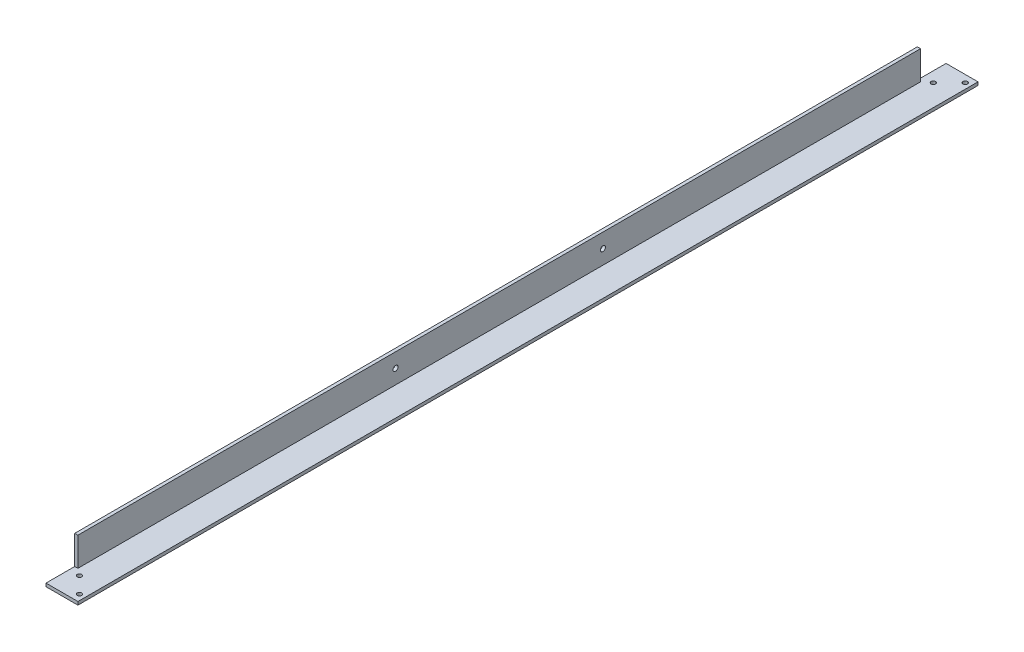
ISO-10303-21;
HEADER;
FILE_DESCRIPTION(('STEP AP214'),'2;1');
FILE_NAME('part.step','',(''),(''),'','','');
FILE_SCHEMA(('AUTOMOTIVE_DESIGN { 1 0 10303 214 1 1 1 1 }'));
ENDSEC;
DATA;
#1=APPLICATION_CONTEXT('core data for automotive mechanical design processes');
#2=APPLICATION_PROTOCOL_DEFINITION('international standard','automotive_design',2000,#1);
#3=PRODUCT_CONTEXT('',#1,'mechanical');
#4=PRODUCT('Part','Part','',(#3));
#5=PRODUCT_RELATED_PRODUCT_CATEGORY('part','',(#4));
#6=PRODUCT_DEFINITION_FORMATION('','',#4);
#7=PRODUCT_DEFINITION_CONTEXT('part definition',#1,'design');
#8=PRODUCT_DEFINITION('design','',#6,#7);
#9=PRODUCT_DEFINITION_SHAPE('','',#8);
#10=(LENGTH_UNIT() NAMED_UNIT(*) SI_UNIT(.MILLI.,.METRE.));
#11=(NAMED_UNIT(*) PLANE_ANGLE_UNIT() SI_UNIT($,.RADIAN.));
#12=(NAMED_UNIT(*) SI_UNIT($,.STERADIAN.) SOLID_ANGLE_UNIT());
#13=UNCERTAINTY_MEASURE_WITH_UNIT(LENGTH_MEASURE(1.E-05),#10,'distance_accuracy_value','');
#14=(GEOMETRIC_REPRESENTATION_CONTEXT(3) GLOBAL_UNCERTAINTY_ASSIGNED_CONTEXT((#13)) GLOBAL_UNIT_ASSIGNED_CONTEXT((#10,
#11,#12)) REPRESENTATION_CONTEXT('',''));
#15=CARTESIAN_POINT('',(0.,0.,0.));
#16=DIRECTION('',(0.,0.,1.));
#17=DIRECTION('',(1.,0.,0.));
#18=AXIS2_PLACEMENT_3D('',#15,#16,#17);
#19=CARTESIAN_POINT('',(0.,20.,564.));
#20=DIRECTION('',(1.,0.,0.));
#21=DIRECTION('',(0.,0.,-1.));
#22=AXIS2_PLACEMENT_3D('',#19,#20,#21);
#23=PLANE('',#22);
#24=CARTESIAN_POINT('',(0.,11.,217.));
#25=DIRECTION('',(-1.,0.,0.));
#26=DIRECTION('',(0.,0.,1.));
#27=AXIS2_PLACEMENT_3D('',#24,#25,#26);
#28=CIRCLE('',#27,1.59999999999999);
#29=CARTESIAN_POINT('',(0.,11.,218.6));
#30=VERTEX_POINT('',#29);
#31=EDGE_CURVE('E179',#30,#30,#28,.T.);
#32=ORIENTED_EDGE('',*,*,#31,.F.);
#33=EDGE_LOOP('',(#32));
#34=FACE_BOUND('',#33,.T.);
#35=CARTESIAN_POINT('',(0.,11.,347.));
#36=DIRECTION('',(-1.,0.,0.));
#37=DIRECTION('',(0.,0.,1.));
#38=AXIS2_PLACEMENT_3D('',#35,#36,#37);
#39=CIRCLE('',#38,1.59999999999996);
#40=CARTESIAN_POINT('',(0.,11.,348.6));
#41=VERTEX_POINT('',#40);
#42=EDGE_CURVE('E185',#41,#41,#39,.T.);
#43=ORIENTED_EDGE('',*,*,#42,.F.);
#44=EDGE_LOOP('',(#43));
#45=FACE_BOUND('',#44,.T.);
#46=DIRECTION('',(0.,0.,-1.));
#47=VECTOR('',#46,1.);
#48=CARTESIAN_POINT('',(0.,2.,564.));
#49=LINE('',#48,#47);
#50=CARTESIAN_POINT('',(0.,2.,564.));
#51=VERTEX_POINT('',#50);
#52=CARTESIAN_POINT('',(0.,2.,546.));
#53=VERTEX_POINT('',#52);
#54=EDGE_CURVE('E119',#51,#53,#49,.T.);
#55=ORIENTED_EDGE('',*,*,#54,.T.);
#56=DIRECTION('',(0.,1.,0.));
#57=VECTOR('',#56,1.);
#58=CARTESIAN_POINT('',(0.,20.,546.));
#59=LINE('',#58,#57);
#60=CARTESIAN_POINT('',(0.,20.,546.));
#61=VERTEX_POINT('',#60);
#62=EDGE_CURVE('E125',#53,#61,#59,.T.);
#63=ORIENTED_EDGE('',*,*,#62,.T.);
#64=DIRECTION('',(0.,0.,-1.));
#65=VECTOR('',#64,1.);
#66=CARTESIAN_POINT('',(0.,20.,564.));
#67=LINE('',#66,#65);
#68=CARTESIAN_POINT('',(0.,20.,18.));
#69=VERTEX_POINT('',#68);
#70=EDGE_CURVE('E164',#61,#69,#67,.T.);
#71=ORIENTED_EDGE('',*,*,#70,.T.);
#72=DIRECTION('',(0.,-1.,0.));
#73=VECTOR('',#72,1.);
#74=CARTESIAN_POINT('',(0.,20.,18.));
#75=LINE('',#74,#73);
#76=CARTESIAN_POINT('',(0.,2.,18.));
#77=VERTEX_POINT('',#76);
#78=EDGE_CURVE('E145',#69,#77,#75,.T.);
#79=ORIENTED_EDGE('',*,*,#78,.T.);
#80=DIRECTION('',(0.,0.,-1.));
#81=VECTOR('',#80,1.);
#82=CARTESIAN_POINT('',(0.,2.,0.));
#83=LINE('',#82,#81);
#84=CARTESIAN_POINT('',(0.,2.,0.));
#85=VERTEX_POINT('',#84);
#86=EDGE_CURVE('E148',#77,#85,#83,.T.);
#87=ORIENTED_EDGE('',*,*,#86,.T.);
#88=DIRECTION('',(0.,-1.,0.));
#89=VECTOR('',#88,1.);
#90=CARTESIAN_POINT('',(0.,20.,0.));
#91=LINE('',#90,#89);
#92=CARTESIAN_POINT('',(0.,0.,0.));
#93=VERTEX_POINT('',#92);
#94=EDGE_CURVE('E143',#85,#93,#91,.T.);
#95=ORIENTED_EDGE('',*,*,#94,.T.);
#96=DIRECTION('',(0.,0.,-1.));
#97=VECTOR('',#96,1.);
#98=CARTESIAN_POINT('',(0.,0.,564.));
#99=LINE('',#98,#97);
#100=CARTESIAN_POINT('',(0.,0.,564.));
#101=VERTEX_POINT('',#100);
#102=EDGE_CURVE('E11',#101,#93,#99,.T.);
#103=ORIENTED_EDGE('',*,*,#102,.F.);
#104=DIRECTION('',(0.,-1.,0.));
#105=VECTOR('',#104,1.);
#106=CARTESIAN_POINT('',(0.,20.,564.));
#107=LINE('',#106,#105);
#108=EDGE_CURVE('E85',#51,#101,#107,.T.);
#109=ORIENTED_EDGE('',*,*,#108,.F.);
#110=EDGE_LOOP('',(#55,#63,#71,#79,#87,#95,#103,#109));
#111=FACE_BOUND('',#110,.T.);
#112=ADVANCED_FACE('F43',(#34,#45,#111),#23,.F.);
#113=CARTESIAN_POINT('',(0.,0.,564.));
#114=DIRECTION('',(0.,1.,0.));
#115=DIRECTION('',(0.,0.,1.));
#116=AXIS2_PLACEMENT_3D('',#113,#114,#115);
#117=PLANE('',#116);
#118=CARTESIAN_POINT('',(16.48,0.,4.48000000000001));
#119=DIRECTION('',(0.,1.,0.));
#120=DIRECTION('',(1.,0.,0.));
#121=AXIS2_PLACEMENT_3D('',#118,#119,#120);
#122=CIRCLE('',#121,1.4);
#123=CARTESIAN_POINT('',(17.88,0.,4.48000000000001));
#124=VERTEX_POINT('',#123);
#125=EDGE_CURVE('E204',#124,#124,#122,.T.);
#126=ORIENTED_EDGE('',*,*,#125,.T.);
#127=EDGE_LOOP('',(#126));
#128=FACE_BOUND('',#127,.T.);
#129=CARTESIAN_POINT('',(16.48,0.,559.52));
#130=DIRECTION('',(0.,1.,0.));
#131=DIRECTION('',(-1.,0.,0.));
#132=AXIS2_PLACEMENT_3D('',#129,#130,#131);
#133=CIRCLE('',#132,1.39999999999999);
#134=CARTESIAN_POINT('',(15.08,0.,559.52));
#135=VERTEX_POINT('',#134);
#136=EDGE_CURVE('E198',#135,#135,#133,.T.);
#137=ORIENTED_EDGE('',*,*,#136,.T.);
#138=EDGE_LOOP('',(#137));
#139=FACE_BOUND('',#138,.T.);
#140=CARTESIAN_POINT('',(6.48,0.,14.48));
#141=DIRECTION('',(0.,1.,0.));
#142=DIRECTION('',(1.,0.,0.));
#143=AXIS2_PLACEMENT_3D('',#140,#141,#142);
#144=CIRCLE('',#143,1.4);
#145=CARTESIAN_POINT('',(7.88,0.,14.48));
#146=VERTEX_POINT('',#145);
#147=EDGE_CURVE('E192',#146,#146,#144,.T.);
#148=ORIENTED_EDGE('',*,*,#147,.T.);
#149=EDGE_LOOP('',(#148));
#150=FACE_BOUND('',#149,.T.);
#151=CARTESIAN_POINT('',(6.48,0.,549.52));
#152=DIRECTION('',(0.,1.,0.));
#153=DIRECTION('',(-1.,0.,0.));
#154=AXIS2_PLACEMENT_3D('',#151,#152,#153);
#155=CIRCLE('',#154,1.39999999999998);
#156=CARTESIAN_POINT('',(5.08000000000002,0.,549.52));
#157=VERTEX_POINT('',#156);
#158=EDGE_CURVE('E155',#157,#157,#155,.T.);
#159=ORIENTED_EDGE('',*,*,#158,.T.);
#160=EDGE_LOOP('',(#159));
#161=FACE_BOUND('',#160,.T.);
#162=DIRECTION('',(1.,0.,0.));
#163=VECTOR('',#162,1.);
#164=CARTESIAN_POINT('',(0.,0.,0.));
#165=LINE('',#164,#163);
#166=CARTESIAN_POINT('',(20.,0.,0.));
#167=VERTEX_POINT('',#166);
#168=EDGE_CURVE('E166',#93,#167,#165,.T.);
#169=ORIENTED_EDGE('',*,*,#168,.T.);
#170=DIRECTION('',(0.,0.,-1.));
#171=VECTOR('',#170,1.);
#172=CARTESIAN_POINT('',(20.,0.,564.));
#173=LINE('',#172,#171);
#174=CARTESIAN_POINT('',(20.,0.,564.));
#175=VERTEX_POINT('',#174);
#176=EDGE_CURVE('E51',#175,#167,#173,.T.);
#177=ORIENTED_EDGE('',*,*,#176,.F.);
#178=DIRECTION('',(1.,0.,0.));
#179=VECTOR('',#178,1.);
#180=CARTESIAN_POINT('',(0.,0.,564.));
#181=LINE('',#180,#179);
#182=EDGE_CURVE('E159',#101,#175,#181,.T.);
#183=ORIENTED_EDGE('',*,*,#182,.F.);
#184=ORIENTED_EDGE('',*,*,#102,.T.);
#185=EDGE_LOOP('',(#169,#177,#183,#184));
#186=FACE_BOUND('',#185,.T.);
#187=ADVANCED_FACE('F229',(#128,#139,#150,#161,#186),#117,.F.);
#188=CARTESIAN_POINT('',(20.,0.,564.));
#189=DIRECTION('',(-1.,0.,0.));
#190=DIRECTION('',(0.,0.,1.));
#191=AXIS2_PLACEMENT_3D('',#188,#189,#190);
#192=PLANE('',#191);
#193=DIRECTION('',(0.,1.,0.));
#194=VECTOR('',#193,1.);
#195=CARTESIAN_POINT('',(20.,0.,0.));
#196=LINE('',#195,#194);
#197=CARTESIAN_POINT('',(20.,2.,0.));
#198=VERTEX_POINT('',#197);
#199=EDGE_CURVE('E82',#167,#198,#196,.T.);
#200=ORIENTED_EDGE('',*,*,#199,.T.);
#201=DIRECTION('',(0.,0.,-1.));
#202=VECTOR('',#201,1.);
#203=CARTESIAN_POINT('',(20.,2.,564.));
#204=LINE('',#203,#202);
#205=CARTESIAN_POINT('',(20.,2.,564.));
#206=VERTEX_POINT('',#205);
#207=EDGE_CURVE('E175',#206,#198,#204,.T.);
#208=ORIENTED_EDGE('',*,*,#207,.F.);
#209=DIRECTION('',(0.,1.,0.));
#210=VECTOR('',#209,1.);
#211=CARTESIAN_POINT('',(20.,0.,564.));
#212=LINE('',#211,#210);
#213=EDGE_CURVE('E65',#175,#206,#212,.T.);
#214=ORIENTED_EDGE('',*,*,#213,.F.);
#215=ORIENTED_EDGE('',*,*,#176,.T.);
#216=EDGE_LOOP('',(#200,#208,#214,#215));
#217=FACE_BOUND('',#216,.T.);
#218=ADVANCED_FACE('F218',(#217),#192,.F.);
#219=CARTESIAN_POINT('',(20.,2.,564.));
#220=DIRECTION('',(0.,-1.,0.));
#221=DIRECTION('',(1.,0.,0.));
#222=AXIS2_PLACEMENT_3D('',#219,#220,#221);
#223=PLANE('',#222);
#224=CARTESIAN_POINT('',(16.48,2.,4.48000000000001));
#225=DIRECTION('',(0.,1.,0.));
#226=DIRECTION('',(1.,0.,0.));
#227=AXIS2_PLACEMENT_3D('',#224,#225,#226);
#228=CIRCLE('',#227,1.4);
#229=CARTESIAN_POINT('',(17.88,2.,4.48000000000001));
#230=VERTEX_POINT('',#229);
#231=EDGE_CURVE('E183',#230,#230,#228,.T.);
#232=ORIENTED_EDGE('',*,*,#231,.F.);
#233=EDGE_LOOP('',(#232));
#234=FACE_BOUND('',#233,.T.);
#235=CARTESIAN_POINT('',(16.48,2.,559.52));
#236=DIRECTION('',(0.,1.,0.));
#237=DIRECTION('',(-1.,0.,0.));
#238=AXIS2_PLACEMENT_3D('',#235,#236,#237);
#239=CIRCLE('',#238,1.39999999999999);
#240=CARTESIAN_POINT('',(15.08,2.,559.52));
#241=VERTEX_POINT('',#240);
#242=EDGE_CURVE('E201',#241,#241,#239,.T.);
#243=ORIENTED_EDGE('',*,*,#242,.F.);
#244=EDGE_LOOP('',(#243));
#245=FACE_BOUND('',#244,.T.);
#246=CARTESIAN_POINT('',(6.48,2.,14.48));
#247=DIRECTION('',(0.,1.,0.));
#248=DIRECTION('',(1.,0.,0.));
#249=AXIS2_PLACEMENT_3D('',#246,#247,#248);
#250=CIRCLE('',#249,1.4);
#251=CARTESIAN_POINT('',(7.88,2.,14.48));
#252=VERTEX_POINT('',#251);
#253=EDGE_CURVE('E195',#252,#252,#250,.T.);
#254=ORIENTED_EDGE('',*,*,#253,.F.);
#255=EDGE_LOOP('',(#254));
#256=FACE_BOUND('',#255,.T.);
#257=CARTESIAN_POINT('',(6.48,2.,549.52));
#258=DIRECTION('',(0.,1.,0.));
#259=DIRECTION('',(-1.,0.,0.));
#260=AXIS2_PLACEMENT_3D('',#257,#258,#259);
#261=CIRCLE('',#260,1.39999999999998);
#262=CARTESIAN_POINT('',(5.08000000000002,2.,549.52));
#263=VERTEX_POINT('',#262);
#264=EDGE_CURVE('E140',#263,#263,#261,.T.);
#265=ORIENTED_EDGE('',*,*,#264,.F.);
#266=EDGE_LOOP('',(#265));
#267=FACE_BOUND('',#266,.T.);
#268=DIRECTION('',(-1.,0.,0.));
#269=VECTOR('',#268,1.);
#270=CARTESIAN_POINT('',(20.,2.,0.));
#271=LINE('',#270,#269);
#272=EDGE_CURVE('E160',#198,#85,#271,.T.);
#273=ORIENTED_EDGE('',*,*,#272,.T.);
#274=ORIENTED_EDGE('',*,*,#86,.F.);
#275=DIRECTION('',(1.,0.,0.));
#276=VECTOR('',#275,1.);
#277=CARTESIAN_POINT('',(0.,2.,18.));
#278=LINE('',#277,#276);
#279=CARTESIAN_POINT('',(2.,2.,18.));
#280=VERTEX_POINT('',#279);
#281=EDGE_CURVE('E137',#77,#280,#278,.T.);
#282=ORIENTED_EDGE('',*,*,#281,.T.);
#283=DIRECTION('',(0.,0.,-1.));
#284=VECTOR('',#283,1.);
#285=CARTESIAN_POINT('',(2.,2.,564.));
#286=LINE('',#285,#284);
#287=CARTESIAN_POINT('',(2.,2.,546.));
#288=VERTEX_POINT('',#287);
#289=EDGE_CURVE('E121',#288,#280,#286,.T.);
#290=ORIENTED_EDGE('',*,*,#289,.F.);
#291=DIRECTION('',(1.,0.,0.));
#292=VECTOR('',#291,1.);
#293=CARTESIAN_POINT('',(0.,2.,546.));
#294=LINE('',#293,#292);
#295=EDGE_CURVE('E115',#53,#288,#294,.T.);
#296=ORIENTED_EDGE('',*,*,#295,.F.);
#297=ORIENTED_EDGE('',*,*,#54,.F.);
#298=DIRECTION('',(-1.,0.,0.));
#299=VECTOR('',#298,1.);
#300=CARTESIAN_POINT('',(20.,2.,564.));
#301=LINE('',#300,#299);
#302=EDGE_CURVE('E59',#206,#51,#301,.T.);
#303=ORIENTED_EDGE('',*,*,#302,.F.);
#304=ORIENTED_EDGE('',*,*,#207,.T.);
#305=EDGE_LOOP('',(#273,#274,#282,#290,#296,#297,#303,#304));
#306=FACE_BOUND('',#305,.T.);
#307=ADVANCED_FACE('F117',(#234,#245,#256,#267,#306),#223,.F.);
#308=CARTESIAN_POINT('',(2.,2.,564.));
#309=DIRECTION('',(-1.,0.,0.));
#310=DIRECTION('',(0.,0.,1.));
#311=AXIS2_PLACEMENT_3D('',#308,#309,#310);
#312=PLANE('',#311);
#313=CARTESIAN_POINT('',(2.,11.,217.));
#314=DIRECTION('',(-1.,0.,0.));
#315=DIRECTION('',(0.,0.,1.));
#316=AXIS2_PLACEMENT_3D('',#313,#314,#315);
#317=CIRCLE('',#316,1.59999999999999);
#318=CARTESIAN_POINT('',(2.,11.,218.6));
#319=VERTEX_POINT('',#318);
#320=EDGE_CURVE('E46',#319,#319,#317,.T.);
#321=ORIENTED_EDGE('',*,*,#320,.T.);
#322=EDGE_LOOP('',(#321));
#323=FACE_BOUND('',#322,.T.);
#324=CARTESIAN_POINT('',(2.,11.,347.));
#325=DIRECTION('',(-1.,0.,0.));
#326=DIRECTION('',(0.,0.,1.));
#327=AXIS2_PLACEMENT_3D('',#324,#325,#326);
#328=CIRCLE('',#327,1.59999999999996);
#329=CARTESIAN_POINT('',(2.,11.,348.6));
#330=VERTEX_POINT('',#329);
#331=EDGE_CURVE('E177',#330,#330,#328,.T.);
#332=ORIENTED_EDGE('',*,*,#331,.T.);
#333=EDGE_LOOP('',(#332));
#334=FACE_BOUND('',#333,.T.);
#335=DIRECTION('',(0.,0.,-1.));
#336=VECTOR('',#335,1.);
#337=CARTESIAN_POINT('',(2.,20.,564.));
#338=LINE('',#337,#336);
#339=CARTESIAN_POINT('',(2.,20.,546.));
#340=VERTEX_POINT('',#339);
#341=CARTESIAN_POINT('',(2.,20.,18.));
#342=VERTEX_POINT('',#341);
#343=EDGE_CURVE('E171',#340,#342,#338,.T.);
#344=ORIENTED_EDGE('',*,*,#343,.F.);
#345=DIRECTION('',(0.,1.,0.));
#346=VECTOR('',#345,1.);
#347=CARTESIAN_POINT('',(2.,20.,546.));
#348=LINE('',#347,#346);
#349=EDGE_CURVE('E135',#288,#340,#348,.T.);
#350=ORIENTED_EDGE('',*,*,#349,.F.);
#351=ORIENTED_EDGE('',*,*,#289,.T.);
#352=DIRECTION('',(0.,-1.,0.));
#353=VECTOR('',#352,1.);
#354=CARTESIAN_POINT('',(2.,20.,18.));
#355=LINE('',#354,#353);
#356=EDGE_CURVE('E149',#342,#280,#355,.T.);
#357=ORIENTED_EDGE('',*,*,#356,.F.);
#358=EDGE_LOOP('',(#344,#350,#351,#357));
#359=FACE_BOUND('',#358,.T.);
#360=ADVANCED_FACE('F217',(#323,#334,#359),#312,.F.);
#361=CARTESIAN_POINT('',(2.,20.,564.));
#362=DIRECTION('',(0.,-1.,0.));
#363=DIRECTION('',(0.,0.,-1.));
#364=AXIS2_PLACEMENT_3D('',#361,#362,#363);
#365=PLANE('',#364);
#366=ORIENTED_EDGE('',*,*,#70,.F.);
#367=DIRECTION('',(1.,0.,0.));
#368=VECTOR('',#367,1.);
#369=CARTESIAN_POINT('',(0.,20.,546.));
#370=LINE('',#369,#368);
#371=EDGE_CURVE('E124',#61,#340,#370,.T.);
#372=ORIENTED_EDGE('',*,*,#371,.T.);
#373=ORIENTED_EDGE('',*,*,#343,.T.);
#374=DIRECTION('',(1.,0.,0.));
#375=VECTOR('',#374,1.);
#376=CARTESIAN_POINT('',(0.,20.,18.));
#377=LINE('',#376,#375);
#378=EDGE_CURVE('E152',#69,#342,#377,.T.);
#379=ORIENTED_EDGE('',*,*,#378,.F.);
#380=EDGE_LOOP('',(#366,#372,#373,#379));
#381=FACE_BOUND('',#380,.T.);
#382=ADVANCED_FACE('F226',(#381),#365,.F.);
#383=CARTESIAN_POINT('',(0.,0.,564.));
#384=DIRECTION('',(0.,0.,1.));
#385=DIRECTION('',(1.,0.,0.));
#386=AXIS2_PLACEMENT_3D('',#383,#384,#385);
#387=PLANE('',#386);
#388=ORIENTED_EDGE('',*,*,#302,.T.);
#389=ORIENTED_EDGE('',*,*,#108,.T.);
#390=ORIENTED_EDGE('',*,*,#182,.T.);
#391=ORIENTED_EDGE('',*,*,#213,.T.);
#392=EDGE_LOOP('',(#388,#389,#390,#391));
#393=FACE_BOUND('',#392,.T.);
#394=ADVANCED_FACE('F275',(#393),#387,.T.);
#395=CARTESIAN_POINT('',(0.,0.,0.));
#396=DIRECTION('',(0.,0.,1.));
#397=DIRECTION('',(1.,0.,0.));
#398=AXIS2_PLACEMENT_3D('',#395,#396,#397);
#399=PLANE('',#398);
#400=ORIENTED_EDGE('',*,*,#94,.F.);
#401=ORIENTED_EDGE('',*,*,#272,.F.);
#402=ORIENTED_EDGE('',*,*,#199,.F.);
#403=ORIENTED_EDGE('',*,*,#168,.F.);
#404=EDGE_LOOP('',(#400,#401,#402,#403));
#405=FACE_BOUND('',#404,.T.);
#406=ADVANCED_FACE('F273',(#405),#399,.F.);
#407=CARTESIAN_POINT('',(0.,20.,18.));
#408=DIRECTION('',(0.,0.,1.));
#409=DIRECTION('',(1.,0.,0.));
#410=AXIS2_PLACEMENT_3D('',#407,#408,#409);
#411=PLANE('',#410);
#412=ORIENTED_EDGE('',*,*,#356,.T.);
#413=ORIENTED_EDGE('',*,*,#281,.F.);
#414=ORIENTED_EDGE('',*,*,#78,.F.);
#415=ORIENTED_EDGE('',*,*,#378,.T.);
#416=EDGE_LOOP('',(#412,#413,#414,#415));
#417=FACE_BOUND('',#416,.T.);
#418=ADVANCED_FACE('F270',(#417),#411,.F.);
#419=CARTESIAN_POINT('',(0.,20.,546.));
#420=DIRECTION('',(0.,0.,-1.));
#421=DIRECTION('',(-1.,0.,0.));
#422=AXIS2_PLACEMENT_3D('',#419,#420,#421);
#423=PLANE('',#422);
#424=ORIENTED_EDGE('',*,*,#349,.T.);
#425=ORIENTED_EDGE('',*,*,#371,.F.);
#426=ORIENTED_EDGE('',*,*,#62,.F.);
#427=ORIENTED_EDGE('',*,*,#295,.T.);
#428=EDGE_LOOP('',(#424,#425,#426,#427));
#429=FACE_BOUND('',#428,.T.);
#430=ADVANCED_FACE('F128',(#429),#423,.F.);
#431=CARTESIAN_POINT('',(6.48,0.,549.52));
#432=DIRECTION('',(0.,1.,0.));
#433=DIRECTION('',(-1.,0.,0.));
#434=AXIS2_PLACEMENT_3D('',#431,#432,#433);
#435=CYLINDRICAL_SURFACE('',#434,1.39999999999998);
#436=ORIENTED_EDGE('',*,*,#158,.F.);
#437=EDGE_LOOP('',(#436));
#438=FACE_BOUND('',#437,.T.);
#439=ORIENTED_EDGE('',*,*,#264,.T.);
#440=EDGE_LOOP('',(#439));
#441=FACE_BOUND('',#440,.T.);
#442=ADVANCED_FACE('F214',(#438,#441),#435,.F.);
#443=CARTESIAN_POINT('',(6.48,0.,14.48));
#444=DIRECTION('',(0.,1.,0.));
#445=DIRECTION('',(-1.,0.,0.));
#446=AXIS2_PLACEMENT_3D('',#443,#444,#445);
#447=CYLINDRICAL_SURFACE('',#446,1.4);
#448=ORIENTED_EDGE('',*,*,#147,.F.);
#449=EDGE_LOOP('',(#448));
#450=FACE_BOUND('',#449,.T.);
#451=ORIENTED_EDGE('',*,*,#253,.T.);
#452=EDGE_LOOP('',(#451));
#453=FACE_BOUND('',#452,.T.);
#454=ADVANCED_FACE('F258',(#450,#453),#447,.F.);
#455=CARTESIAN_POINT('',(16.48,0.,559.52));
#456=DIRECTION('',(0.,1.,0.));
#457=DIRECTION('',(-1.,0.,0.));
#458=AXIS2_PLACEMENT_3D('',#455,#456,#457);
#459=CYLINDRICAL_SURFACE('',#458,1.39999999999999);
#460=ORIENTED_EDGE('',*,*,#136,.F.);
#461=EDGE_LOOP('',(#460));
#462=FACE_BOUND('',#461,.T.);
#463=ORIENTED_EDGE('',*,*,#242,.T.);
#464=EDGE_LOOP('',(#463));
#465=FACE_BOUND('',#464,.T.);
#466=ADVANCED_FACE('F254',(#462,#465),#459,.F.);
#467=CARTESIAN_POINT('',(16.48,0.,4.48000000000001));
#468=DIRECTION('',(0.,1.,0.));
#469=DIRECTION('',(-1.,0.,0.));
#470=AXIS2_PLACEMENT_3D('',#467,#468,#469);
#471=CYLINDRICAL_SURFACE('',#470,1.4);
#472=ORIENTED_EDGE('',*,*,#125,.F.);
#473=EDGE_LOOP('',(#472));
#474=FACE_BOUND('',#473,.T.);
#475=ORIENTED_EDGE('',*,*,#231,.T.);
#476=EDGE_LOOP('',(#475));
#477=FACE_BOUND('',#476,.T.);
#478=ADVANCED_FACE('F247',(#474,#477),#471,.F.);
#479=CARTESIAN_POINT('',(20.,11.,347.));
#480=DIRECTION('',(-1.,0.,0.));
#481=DIRECTION('',(0.,0.,1.));
#482=AXIS2_PLACEMENT_3D('',#479,#480,#481);
#483=CYLINDRICAL_SURFACE('',#482,1.59999999999996);
#484=ORIENTED_EDGE('',*,*,#42,.T.);
#485=EDGE_LOOP('',(#484));
#486=FACE_BOUND('',#485,.T.);
#487=ORIENTED_EDGE('',*,*,#331,.F.);
#488=EDGE_LOOP('',(#487));
#489=FACE_BOUND('',#488,.T.);
#490=ADVANCED_FACE('F243',(#486,#489),#483,.F.);
#491=CARTESIAN_POINT('',(20.,11.,217.));
#492=DIRECTION('',(-1.,0.,0.));
#493=DIRECTION('',(0.,0.,1.));
#494=AXIS2_PLACEMENT_3D('',#491,#492,#493);
#495=CYLINDRICAL_SURFACE('',#494,1.59999999999999);
#496=ORIENTED_EDGE('',*,*,#31,.T.);
#497=EDGE_LOOP('',(#496));
#498=FACE_BOUND('',#497,.T.);
#499=ORIENTED_EDGE('',*,*,#320,.F.);
#500=EDGE_LOOP('',(#499));
#501=FACE_BOUND('',#500,.T.);
#502=ADVANCED_FACE('F246',(#498,#501),#495,.F.);
#503=CLOSED_SHELL('',(#112,#187,#218,#307,#360,#382,#394,#406,#418,#430,#442,#454,#466,#478,
#490,#502));
#504=MANIFOLD_SOLID_BREP('B2',#503);
#505=ADVANCED_BREP_SHAPE_REPRESENTATION('',(#18,#504),#14);
#506=SHAPE_DEFINITION_REPRESENTATION(#9,#505);
ENDSEC;
END-ISO-10303-21;
